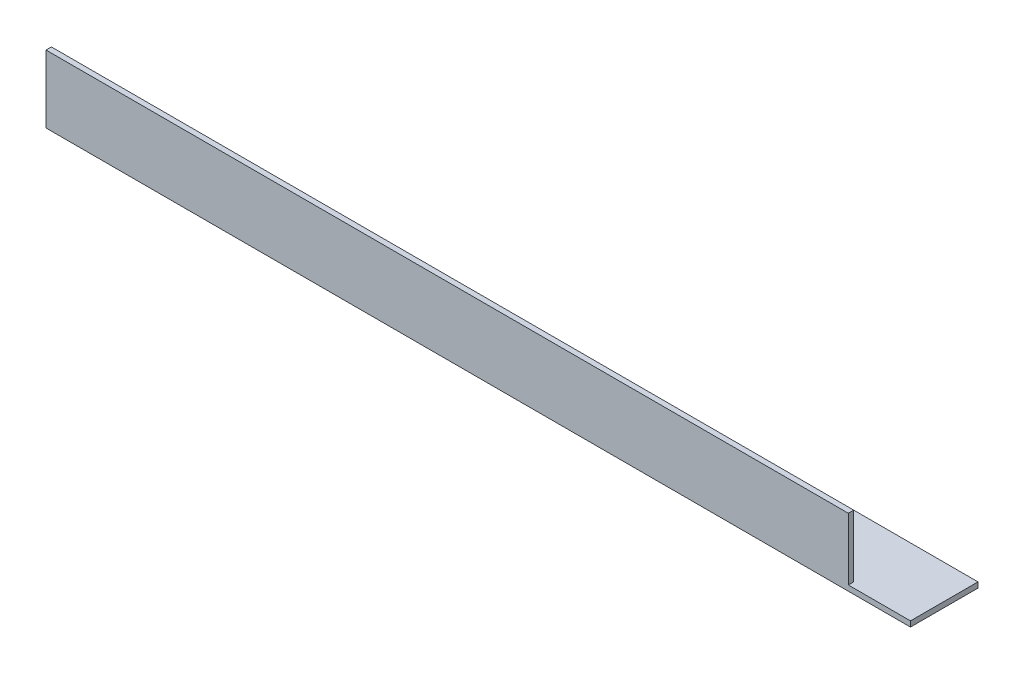
ISO-10303-21;
HEADER;
FILE_DESCRIPTION(('STEP AP214'),'2;1');
FILE_NAME('part.step','',(''),(''),'','','');
FILE_SCHEMA(('AUTOMOTIVE_DESIGN { 1 0 10303 214 1 1 1 1 }'));
ENDSEC;
DATA;
#1=APPLICATION_CONTEXT('core data for automotive mechanical design processes');
#2=APPLICATION_PROTOCOL_DEFINITION('international standard','automotive_design',2000,#1);
#3=PRODUCT_CONTEXT('',#1,'mechanical');
#4=PRODUCT('Part','Part','',(#3));
#5=PRODUCT_RELATED_PRODUCT_CATEGORY('part','',(#4));
#6=PRODUCT_DEFINITION_FORMATION('','',#4);
#7=PRODUCT_DEFINITION_CONTEXT('part definition',#1,'design');
#8=PRODUCT_DEFINITION('design','',#6,#7);
#9=PRODUCT_DEFINITION_SHAPE('','',#8);
#10=(LENGTH_UNIT() NAMED_UNIT(*) SI_UNIT(.MILLI.,.METRE.));
#11=(NAMED_UNIT(*) PLANE_ANGLE_UNIT() SI_UNIT($,.RADIAN.));
#12=(NAMED_UNIT(*) SI_UNIT($,.STERADIAN.) SOLID_ANGLE_UNIT());
#13=UNCERTAINTY_MEASURE_WITH_UNIT(LENGTH_MEASURE(1.E-05),#10,'distance_accuracy_value','');
#14=(GEOMETRIC_REPRESENTATION_CONTEXT(3) GLOBAL_UNCERTAINTY_ASSIGNED_CONTEXT((#13)) GLOBAL_UNIT_ASSIGNED_CONTEXT((#10,
#11,#12)) REPRESENTATION_CONTEXT('',''));
#15=CARTESIAN_POINT('',(0.,0.,0.));
#16=DIRECTION('',(0.,0.,1.));
#17=DIRECTION('',(1.,0.,0.));
#18=AXIS2_PLACEMENT_3D('',#15,#16,#17);
#19=CARTESIAN_POINT('',(320.,0.,0.));
#20=DIRECTION('',(0.,1.,0.));
#21=DIRECTION('',(0.,0.,1.));
#22=AXIS2_PLACEMENT_3D('',#19,#20,#21);
#23=PLANE('',#22);
#24=DIRECTION('',(0.,0.,-1.));
#25=VECTOR('',#24,1.);
#26=CARTESIAN_POINT('',(0.,0.,0.));
#27=LINE('',#26,#25);
#28=CARTESIAN_POINT('',(0.,0.,0.));
#29=VERTEX_POINT('',#28);
#30=CARTESIAN_POINT('',(0.,0.,-25.));
#31=VERTEX_POINT('',#30);
#32=EDGE_CURVE('E122',#29,#31,#27,.T.);
#33=ORIENTED_EDGE('',*,*,#32,.T.);
#34=DIRECTION('',(-1.,0.,0.));
#35=VECTOR('',#34,1.);
#36=CARTESIAN_POINT('',(320.,0.,-25.));
#37=LINE('',#36,#35);
#38=CARTESIAN_POINT('',(320.,0.,-25.));
#39=VERTEX_POINT('',#38);
#40=EDGE_CURVE('E11',#39,#31,#37,.T.);
#41=ORIENTED_EDGE('',*,*,#40,.F.);
#42=DIRECTION('',(0.,0.,-1.));
#43=VECTOR('',#42,1.);
#44=CARTESIAN_POINT('',(320.,0.,0.));
#45=LINE('',#44,#43);
#46=CARTESIAN_POINT('',(320.,0.,0.));
#47=VERTEX_POINT('',#46);
#48=EDGE_CURVE('E84',#47,#39,#45,.T.);
#49=ORIENTED_EDGE('',*,*,#48,.F.);
#50=DIRECTION('',(-1.,0.,0.));
#51=VECTOR('',#50,1.);
#52=CARTESIAN_POINT('',(320.,0.,0.));
#53=LINE('',#52,#51);
#54=EDGE_CURVE('E129',#47,#29,#53,.T.);
#55=ORIENTED_EDGE('',*,*,#54,.T.);
#56=EDGE_LOOP('',(#33,#41,#49,#55));
#57=FACE_BOUND('',#56,.T.);
#58=ADVANCED_FACE('F36',(#57),#23,.F.);
#59=CARTESIAN_POINT('',(320.,2.,-25.));
#60=DIRECTION('',(0.,0.,-1.));
#61=DIRECTION('',(-1.,0.,0.));
#62=AXIS2_PLACEMENT_3D('',#59,#60,#61);
#63=PLANE('',#62);
#64=DIRECTION('',(0.,-1.,0.));
#65=VECTOR('',#64,1.);
#66=CARTESIAN_POINT('',(0.,2.,-25.));
#67=LINE('',#66,#65);
#68=CARTESIAN_POINT('',(0.,2.,-25.));
#69=VERTEX_POINT('',#68);
#70=EDGE_CURVE('E132',#69,#31,#67,.T.);
#71=ORIENTED_EDGE('',*,*,#70,.F.);
#72=DIRECTION('',(-1.,0.,0.));
#73=VECTOR('',#72,1.);
#74=CARTESIAN_POINT('',(320.,2.,-25.));
#75=LINE('',#74,#73);
#76=CARTESIAN_POINT('',(320.,2.,-25.));
#77=VERTEX_POINT('',#76);
#78=EDGE_CURVE('E43',#77,#69,#75,.T.);
#79=ORIENTED_EDGE('',*,*,#78,.F.);
#80=DIRECTION('',(0.,-1.,0.));
#81=VECTOR('',#80,1.);
#82=CARTESIAN_POINT('',(320.,2.,-25.));
#83=LINE('',#82,#81);
#84=EDGE_CURVE('E124',#77,#39,#83,.T.);
#85=ORIENTED_EDGE('',*,*,#84,.T.);
#86=ORIENTED_EDGE('',*,*,#40,.T.);
#87=EDGE_LOOP('',(#71,#79,#85,#86));
#88=FACE_BOUND('',#87,.T.);
#89=ADVANCED_FACE('F152',(#88),#63,.T.);
#90=CARTESIAN_POINT('',(320.,2.,0.));
#91=DIRECTION('',(0.,1.,0.));
#92=DIRECTION('',(0.,0.,1.));
#93=AXIS2_PLACEMENT_3D('',#90,#91,#92);
#94=PLANE('',#93);
#95=DIRECTION('',(-1.,0.,0.));
#96=VECTOR('',#95,1.);
#97=CARTESIAN_POINT('',(320.,2.,-2.));
#98=LINE('',#97,#96);
#99=CARTESIAN_POINT('',(297.,2.,-2.));
#100=VERTEX_POINT('',#99);
#101=CARTESIAN_POINT('',(0.,2.,-2.));
#102=VERTEX_POINT('',#101);
#103=EDGE_CURVE('E105',#100,#102,#98,.T.);
#104=ORIENTED_EDGE('',*,*,#103,.F.);
#105=DIRECTION('',(0.,0.,1.));
#106=VECTOR('',#105,1.);
#107=CARTESIAN_POINT('',(297.,2.,-25.));
#108=LINE('',#107,#106);
#109=CARTESIAN_POINT('',(297.,2.,0.));
#110=VERTEX_POINT('',#109);
#111=EDGE_CURVE('E99',#100,#110,#108,.T.);
#112=ORIENTED_EDGE('',*,*,#111,.T.);
#113=DIRECTION('',(1.,0.,0.));
#114=VECTOR('',#113,1.);
#115=CARTESIAN_POINT('',(297.,2.,0.));
#116=LINE('',#115,#114);
#117=CARTESIAN_POINT('',(320.,2.,0.));
#118=VERTEX_POINT('',#117);
#119=EDGE_CURVE('E103',#110,#118,#116,.T.);
#120=ORIENTED_EDGE('',*,*,#119,.T.);
#121=DIRECTION('',(0.,0.,-1.));
#122=VECTOR('',#121,1.);
#123=CARTESIAN_POINT('',(320.,2.,0.));
#124=LINE('',#123,#122);
#125=EDGE_CURVE('E50',#118,#77,#124,.T.);
#126=ORIENTED_EDGE('',*,*,#125,.T.);
#127=ORIENTED_EDGE('',*,*,#78,.T.);
#128=DIRECTION('',(0.,0.,-1.));
#129=VECTOR('',#128,1.);
#130=CARTESIAN_POINT('',(0.,2.,0.));
#131=LINE('',#130,#129);
#132=EDGE_CURVE('E135',#102,#69,#131,.T.);
#133=ORIENTED_EDGE('',*,*,#132,.F.);
#134=EDGE_LOOP('',(#104,#112,#120,#126,#127,#133));
#135=FACE_BOUND('',#134,.T.);
#136=ADVANCED_FACE('F101',(#135),#94,.T.);
#137=CARTESIAN_POINT('',(320.,25.,-2.));
#138=DIRECTION('',(0.,0.,-1.));
#139=DIRECTION('',(0.,1.,0.));
#140=AXIS2_PLACEMENT_3D('',#137,#138,#139);
#141=PLANE('',#140);
#142=DIRECTION('',(0.,1.,0.));
#143=VECTOR('',#142,1.);
#144=CARTESIAN_POINT('',(297.,25.,-2.));
#145=LINE('',#144,#143);
#146=CARTESIAN_POINT('',(297.,25.,-2.));
#147=VERTEX_POINT('',#146);
#148=EDGE_CURVE('E119',#100,#147,#145,.T.);
#149=ORIENTED_EDGE('',*,*,#148,.F.);
#150=ORIENTED_EDGE('',*,*,#103,.T.);
#151=DIRECTION('',(0.,-1.,0.));
#152=VECTOR('',#151,1.);
#153=CARTESIAN_POINT('',(0.,25.,-2.));
#154=LINE('',#153,#152);
#155=CARTESIAN_POINT('',(0.,25.,-2.));
#156=VERTEX_POINT('',#155);
#157=EDGE_CURVE('E138',#156,#102,#154,.T.);
#158=ORIENTED_EDGE('',*,*,#157,.F.);
#159=DIRECTION('',(-1.,0.,0.));
#160=VECTOR('',#159,1.);
#161=CARTESIAN_POINT('',(320.,25.,-2.));
#162=LINE('',#161,#160);
#163=EDGE_CURVE('E148',#147,#156,#162,.T.);
#164=ORIENTED_EDGE('',*,*,#163,.F.);
#165=EDGE_LOOP('',(#149,#150,#158,#164));
#166=FACE_BOUND('',#165,.T.);
#167=ADVANCED_FACE('F160',(#166),#141,.T.);
#168=CARTESIAN_POINT('',(320.,25.,0.));
#169=DIRECTION('',(0.,1.,0.));
#170=DIRECTION('',(0.,0.,1.));
#171=AXIS2_PLACEMENT_3D('',#168,#169,#170);
#172=PLANE('',#171);
#173=DIRECTION('',(0.,0.,1.));
#174=VECTOR('',#173,1.);
#175=CARTESIAN_POINT('',(297.,25.,-25.));
#176=LINE('',#175,#174);
#177=CARTESIAN_POINT('',(297.,25.,0.));
#178=VERTEX_POINT('',#177);
#179=EDGE_CURVE('E108',#147,#178,#176,.T.);
#180=ORIENTED_EDGE('',*,*,#179,.F.);
#181=ORIENTED_EDGE('',*,*,#163,.T.);
#182=DIRECTION('',(0.,0.,-1.));
#183=VECTOR('',#182,1.);
#184=CARTESIAN_POINT('',(0.,25.,0.));
#185=LINE('',#184,#183);
#186=CARTESIAN_POINT('',(0.,25.,0.));
#187=VERTEX_POINT('',#186);
#188=EDGE_CURVE('E141',#187,#156,#185,.T.);
#189=ORIENTED_EDGE('',*,*,#188,.F.);
#190=DIRECTION('',(-1.,0.,0.));
#191=VECTOR('',#190,1.);
#192=CARTESIAN_POINT('',(320.,25.,0.));
#193=LINE('',#192,#191);
#194=EDGE_CURVE('E146',#178,#187,#193,.T.);
#195=ORIENTED_EDGE('',*,*,#194,.F.);
#196=EDGE_LOOP('',(#180,#181,#189,#195));
#197=FACE_BOUND('',#196,.T.);
#198=ADVANCED_FACE('F162',(#197),#172,.T.);
#199=CARTESIAN_POINT('',(320.,25.,0.));
#200=DIRECTION('',(0.,0.,-1.));
#201=DIRECTION('',(0.,1.,0.));
#202=AXIS2_PLACEMENT_3D('',#199,#200,#201);
#203=PLANE('',#202);
#204=ORIENTED_EDGE('',*,*,#119,.F.);
#205=DIRECTION('',(0.,-1.,0.));
#206=VECTOR('',#205,1.);
#207=CARTESIAN_POINT('',(297.,2.,0.));
#208=LINE('',#207,#206);
#209=EDGE_CURVE('E111',#178,#110,#208,.T.);
#210=ORIENTED_EDGE('',*,*,#209,.F.);
#211=ORIENTED_EDGE('',*,*,#194,.T.);
#212=DIRECTION('',(0.,-1.,0.));
#213=VECTOR('',#212,1.);
#214=CARTESIAN_POINT('',(0.,25.,0.));
#215=LINE('',#214,#213);
#216=EDGE_CURVE('E81',#187,#29,#215,.T.);
#217=ORIENTED_EDGE('',*,*,#216,.T.);
#218=ORIENTED_EDGE('',*,*,#54,.F.);
#219=DIRECTION('',(0.,-1.,0.));
#220=VECTOR('',#219,1.);
#221=CARTESIAN_POINT('',(320.,25.,0.));
#222=LINE('',#221,#220);
#223=EDGE_CURVE('E56',#118,#47,#222,.T.);
#224=ORIENTED_EDGE('',*,*,#223,.F.);
#225=EDGE_LOOP('',(#204,#210,#211,#217,#218,#224));
#226=FACE_BOUND('',#225,.T.);
#227=ADVANCED_FACE('F116',(#226),#203,.F.);
#228=CARTESIAN_POINT('',(320.,0.,0.));
#229=DIRECTION('',(-1.,0.,0.));
#230=DIRECTION('',(0.,0.,1.));
#231=AXIS2_PLACEMENT_3D('',#228,#229,#230);
#232=PLANE('',#231);
#233=ORIENTED_EDGE('',*,*,#125,.F.);
#234=ORIENTED_EDGE('',*,*,#223,.T.);
#235=ORIENTED_EDGE('',*,*,#48,.T.);
#236=ORIENTED_EDGE('',*,*,#84,.F.);
#237=EDGE_LOOP('',(#233,#234,#235,#236));
#238=FACE_BOUND('',#237,.T.);
#239=ADVANCED_FACE('F164',(#238),#232,.F.);
#240=CARTESIAN_POINT('',(0.,0.,0.));
#241=DIRECTION('',(-1.,0.,0.));
#242=DIRECTION('',(0.,0.,1.));
#243=AXIS2_PLACEMENT_3D('',#240,#241,#242);
#244=PLANE('',#243);
#245=ORIENTED_EDGE('',*,*,#32,.F.);
#246=ORIENTED_EDGE('',*,*,#216,.F.);
#247=ORIENTED_EDGE('',*,*,#188,.T.);
#248=ORIENTED_EDGE('',*,*,#157,.T.);
#249=ORIENTED_EDGE('',*,*,#132,.T.);
#250=ORIENTED_EDGE('',*,*,#70,.T.);
#251=EDGE_LOOP('',(#245,#246,#247,#248,#249,#250));
#252=FACE_BOUND('',#251,.T.);
#253=ADVANCED_FACE('F155',(#252),#244,.T.);
#254=CARTESIAN_POINT('',(297.,2.,-25.));
#255=DIRECTION('',(-1.,0.,0.));
#256=DIRECTION('',(0.,0.,1.));
#257=AXIS2_PLACEMENT_3D('',#254,#255,#256);
#258=PLANE('',#257);
#259=ORIENTED_EDGE('',*,*,#148,.T.);
#260=ORIENTED_EDGE('',*,*,#179,.T.);
#261=ORIENTED_EDGE('',*,*,#209,.T.);
#262=ORIENTED_EDGE('',*,*,#111,.F.);
#263=EDGE_LOOP('',(#259,#260,#261,#262));
#264=FACE_BOUND('',#263,.T.);
#265=ADVANCED_FACE('F112',(#264),#258,.F.);
#266=CLOSED_SHELL('',(#58,#89,#136,#167,#198,#227,#239,#253,#265));
#267=MANIFOLD_SOLID_BREP('B2',#266);
#268=ADVANCED_BREP_SHAPE_REPRESENTATION('',(#18,#267),#14);
#269=SHAPE_DEFINITION_REPRESENTATION(#9,#268);
ENDSEC;
END-ISO-10303-21;
